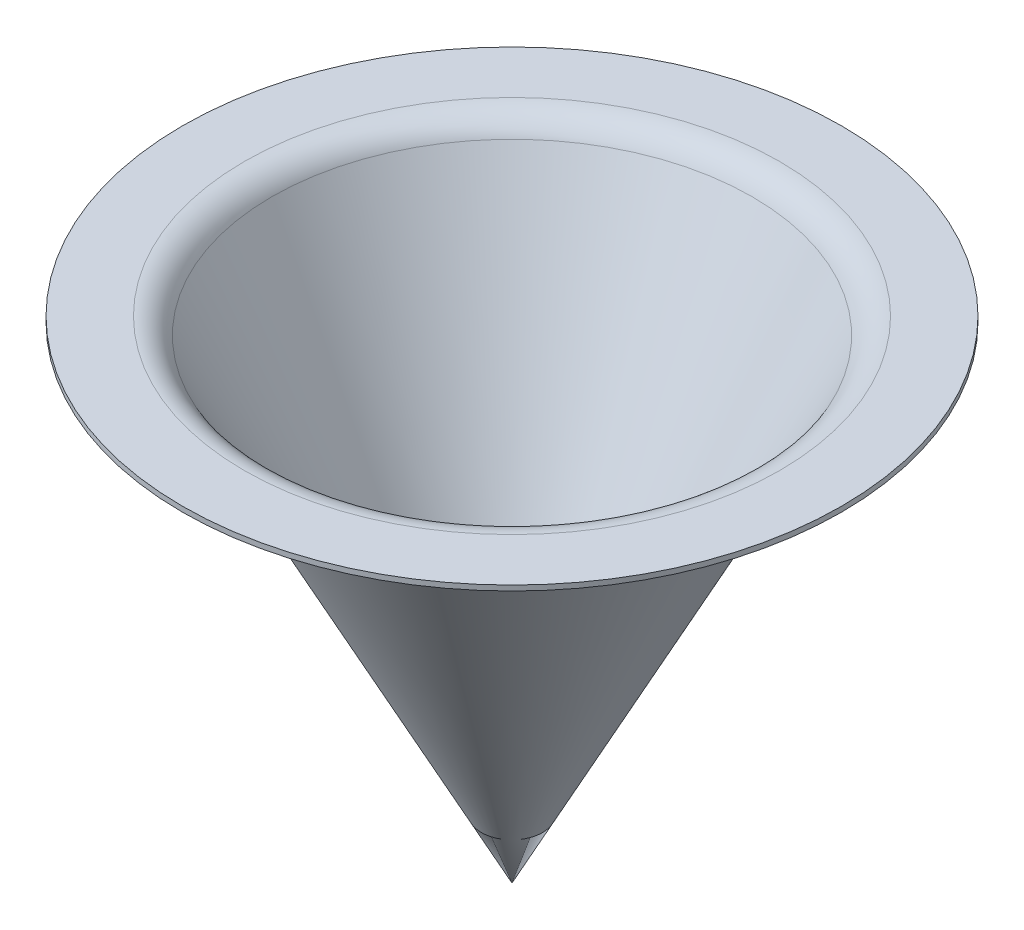
ISO-10303-21;
HEADER;
FILE_DESCRIPTION(('STEP AP214'),'2;1');
FILE_NAME('part.step','',(''),(''),'','','');
FILE_SCHEMA(('AUTOMOTIVE_DESIGN { 1 0 10303 214 1 1 1 1 }'));
ENDSEC;
DATA;
#1=APPLICATION_CONTEXT('core data for automotive mechanical design processes');
#2=APPLICATION_PROTOCOL_DEFINITION('international standard','automotive_design',2000,#1);
#3=PRODUCT_CONTEXT('',#1,'mechanical');
#4=PRODUCT('Part','Part','',(#3));
#5=PRODUCT_RELATED_PRODUCT_CATEGORY('part','',(#4));
#6=PRODUCT_DEFINITION_FORMATION('','',#4);
#7=PRODUCT_DEFINITION_CONTEXT('part definition',#1,'design');
#8=PRODUCT_DEFINITION('design','',#6,#7);
#9=PRODUCT_DEFINITION_SHAPE('','',#8);
#10=(LENGTH_UNIT() NAMED_UNIT(*) SI_UNIT(.MILLI.,.METRE.));
#11=(NAMED_UNIT(*) PLANE_ANGLE_UNIT() SI_UNIT($,.RADIAN.));
#12=(NAMED_UNIT(*) SI_UNIT($,.STERADIAN.) SOLID_ANGLE_UNIT());
#13=UNCERTAINTY_MEASURE_WITH_UNIT(LENGTH_MEASURE(1.E-05),#10,'distance_accuracy_value','');
#14=(GEOMETRIC_REPRESENTATION_CONTEXT(3) GLOBAL_UNCERTAINTY_ASSIGNED_CONTEXT((#13)) GLOBAL_UNIT_ASSIGNED_CONTEXT((#10,
#11,#12)) REPRESENTATION_CONTEXT('',''));
#15=CARTESIAN_POINT('',(0.,0.,0.));
#16=DIRECTION('',(0.,0.,1.));
#17=DIRECTION('',(1.,0.,0.));
#18=AXIS2_PLACEMENT_3D('',#15,#16,#17);
#19=CARTESIAN_POINT('',(0.,18.8,0.));
#20=DIRECTION('',(0.,1.,0.));
#21=DIRECTION('',(-1.,0.,0.));
#22=AXIS2_PLACEMENT_3D('',#19,#20,#21);
#23=CONICAL_SURFACE('',#22,9.75,0.478430059076064);
#24=CARTESIAN_POINT('',(0.,18.2603860774081,0.));
#25=DIRECTION('',(0.,1.,0.));
#26=DIRECTION('',(-1.,0.,0.));
#27=AXIS2_PLACEMENT_3D('',#24,#25,#26);
#28=CIRCLE('',#27,9.47014703482602);
#29=CARTESIAN_POINT('',(-9.47014703482602,18.2603860774081,0.));
#30=VERTEX_POINT('',#29);
#31=EDGE_CURVE('E11',#30,#30,#28,.F.);
#32=ORIENTED_EDGE('',*,*,#31,.T.);
#33=EDGE_LOOP('',(#32));
#34=FACE_BOUND('',#33,.T.);
#35=CARTESIAN_POINT('',(0.,0.,0.));
#36=VERTEX_POINT('',#35);
#37=VERTEX_LOOP('',#36);
#38=FACE_BOUND('',#37,.T.);
#39=ADVANCED_FACE('F37',(#34,#38),#23,.T.);
#40=CARTESIAN_POINT('',(-9.75,18.8,0.));
#41=DIRECTION('',(0.,-1.,0.));
#42=DIRECTION('',(1.,0.,0.));
#43=AXIS2_PLACEMENT_3D('',#40,#41,#42);
#44=PLANE('',#43);
#45=CARTESIAN_POINT('',(0.,18.8,0.));
#46=DIRECTION('',(0.,-1.,0.));
#47=DIRECTION('',(1.,0.,0.));
#48=AXIS2_PLACEMENT_3D('',#45,#46,#47);
#49=CIRCLE('',#48,10.3578658302386);
#50=CARTESIAN_POINT('',(10.3578658302386,18.8,0.));
#51=VERTEX_POINT('',#50);
#52=EDGE_CURVE('E45',#51,#51,#49,.F.);
#53=ORIENTED_EDGE('',*,*,#52,.T.);
#54=EDGE_LOOP('',(#53));
#55=FACE_BOUND('',#54,.T.);
#56=CARTESIAN_POINT('',(0.,18.8,0.));
#57=DIRECTION('',(0.,1.,0.));
#58=DIRECTION('',(-1.,0.,0.));
#59=AXIS2_PLACEMENT_3D('',#56,#57,#58);
#60=CIRCLE('',#59,12.75);
#61=CARTESIAN_POINT('',(-12.75,18.8,0.));
#62=VERTEX_POINT('',#61);
#63=EDGE_CURVE('E90',#62,#62,#60,.T.);
#64=ORIENTED_EDGE('',*,*,#63,.F.);
#65=EDGE_LOOP('',(#64));
#66=FACE_BOUND('',#65,.T.);
#67=ADVANCED_FACE('F66',(#55,#66),#44,.T.);
#68=CARTESIAN_POINT('',(0.,19.,0.));
#69=DIRECTION('',(0.,1.,0.));
#70=DIRECTION('',(-1.,0.,0.));
#71=AXIS2_PLACEMENT_3D('',#68,#69,#70);
#72=CYLINDRICAL_SURFACE('',#71,12.75);
#73=ORIENTED_EDGE('',*,*,#63,.T.);
#74=EDGE_LOOP('',(#73));
#75=FACE_BOUND('',#74,.T.);
#76=CARTESIAN_POINT('',(0.,19.,0.));
#77=DIRECTION('',(0.,1.,0.));
#78=DIRECTION('',(-1.,0.,0.));
#79=AXIS2_PLACEMENT_3D('',#76,#77,#78);
#80=CIRCLE('',#79,12.75);
#81=CARTESIAN_POINT('',(-12.75,19.,0.));
#82=VERTEX_POINT('',#81);
#83=EDGE_CURVE('E88',#82,#82,#80,.T.);
#84=ORIENTED_EDGE('',*,*,#83,.F.);
#85=EDGE_LOOP('',(#84));
#86=FACE_BOUND('',#85,.T.);
#87=ADVANCED_FACE('F71',(#75,#86),#72,.T.);
#88=CARTESIAN_POINT('',(-12.75,19.,0.));
#89=DIRECTION('',(0.,1.,0.));
#90=DIRECTION('',(-1.,0.,0.));
#91=AXIS2_PLACEMENT_3D('',#88,#89,#90);
#92=PLANE('',#91);
#93=CARTESIAN_POINT('',(0.,19.,0.));
#94=DIRECTION('',(0.,-1.,0.));
#95=DIRECTION('',(1.,0.,0.));
#96=AXIS2_PLACEMENT_3D('',#93,#94,#95);
#97=CIRCLE('',#96,10.3578658302386);
#98=CARTESIAN_POINT('',(10.3578658302386,19.,0.));
#99=VERTEX_POINT('',#98);
#100=EDGE_CURVE('E85',#99,#99,#97,.F.);
#101=ORIENTED_EDGE('',*,*,#100,.F.);
#102=EDGE_LOOP('',(#101));
#103=FACE_BOUND('',#102,.T.);
#104=ORIENTED_EDGE('',*,*,#83,.T.);
#105=EDGE_LOOP('',(#104));
#106=FACE_BOUND('',#105,.T.);
#107=ADVANCED_FACE('F62',(#103,#106),#92,.T.);
#108=CARTESIAN_POINT('',(0.,17.8,0.));
#109=DIRECTION('',(0.,-1.,0.));
#110=DIRECTION('',(1.,0.,0.));
#111=AXIS2_PLACEMENT_3D('',#108,#109,#110);
#112=TOROIDAL_SURFACE('',#111,10.3578658302386,1.);
#113=ORIENTED_EDGE('',*,*,#31,.F.);
#114=EDGE_LOOP('',(#113));
#115=FACE_BOUND('',#114,.T.);
#116=ORIENTED_EDGE('',*,*,#52,.F.);
#117=EDGE_LOOP('',(#116));
#118=FACE_BOUND('',#117,.T.);
#119=ADVANCED_FACE('F39',(#115,#118),#112,.F.);
#120=CARTESIAN_POINT('',(0.,18.8920772154816,0.));
#121=DIRECTION('',(0.,1.,0.));
#122=DIRECTION('',(-1.,0.,0.));
#123=AXIS2_PLACEMENT_3D('',#120,#121,#122);
#124=CONICAL_SURFACE('',#123,9.57245624091748,0.478430059076064);
#125=CARTESIAN_POINT('',(0.,18.3524632928897,0.));
#126=DIRECTION('',(0.,1.,0.));
#127=DIRECTION('',(-1.,0.,0.));
#128=AXIS2_PLACEMENT_3D('',#125,#126,#127);
#129=CIRCLE('',#128,9.2926032757435);
#130=CARTESIAN_POINT('',(-9.2926032757435,18.3524632928897,0.));
#131=VERTEX_POINT('',#130);
#132=EDGE_CURVE('E91',#131,#131,#129,.F.);
#133=ORIENTED_EDGE('',*,*,#132,.F.);
#134=EDGE_LOOP('',(#133));
#135=FACE_BOUND('',#134,.T.);
#136=CARTESIAN_POINT('',(0.,0.434418002225344,0.));
#137=VERTEX_POINT('',#136);
#138=VERTEX_LOOP('',#137);
#139=FACE_BOUND('',#138,.T.);
#140=ADVANCED_FACE('F51',(#135,#139),#124,.F.);
#141=CARTESIAN_POINT('',(0.,17.8,0.));
#142=DIRECTION('',(0.,-1.,0.));
#143=DIRECTION('',(1.,0.,0.));
#144=AXIS2_PLACEMENT_3D('',#141,#142,#143);
#145=TOROIDAL_SURFACE('',#144,10.3578658302386,1.2);
#146=ORIENTED_EDGE('',*,*,#132,.T.);
#147=EDGE_LOOP('',(#146));
#148=FACE_BOUND('',#147,.T.);
#149=ORIENTED_EDGE('',*,*,#100,.T.);
#150=EDGE_LOOP('',(#149));
#151=FACE_BOUND('',#150,.T.);
#152=ADVANCED_FACE('F53',(#148,#151),#145,.T.);
#153=CLOSED_SHELL('',(#39,#67,#87,#107,#119,#140,#152));
#154=MANIFOLD_SOLID_BREP('B2',#153);
#155=ADVANCED_BREP_SHAPE_REPRESENTATION('',(#18,#154),#14);
#156=SHAPE_DEFINITION_REPRESENTATION(#9,#155);
ENDSEC;
END-ISO-10303-21;
